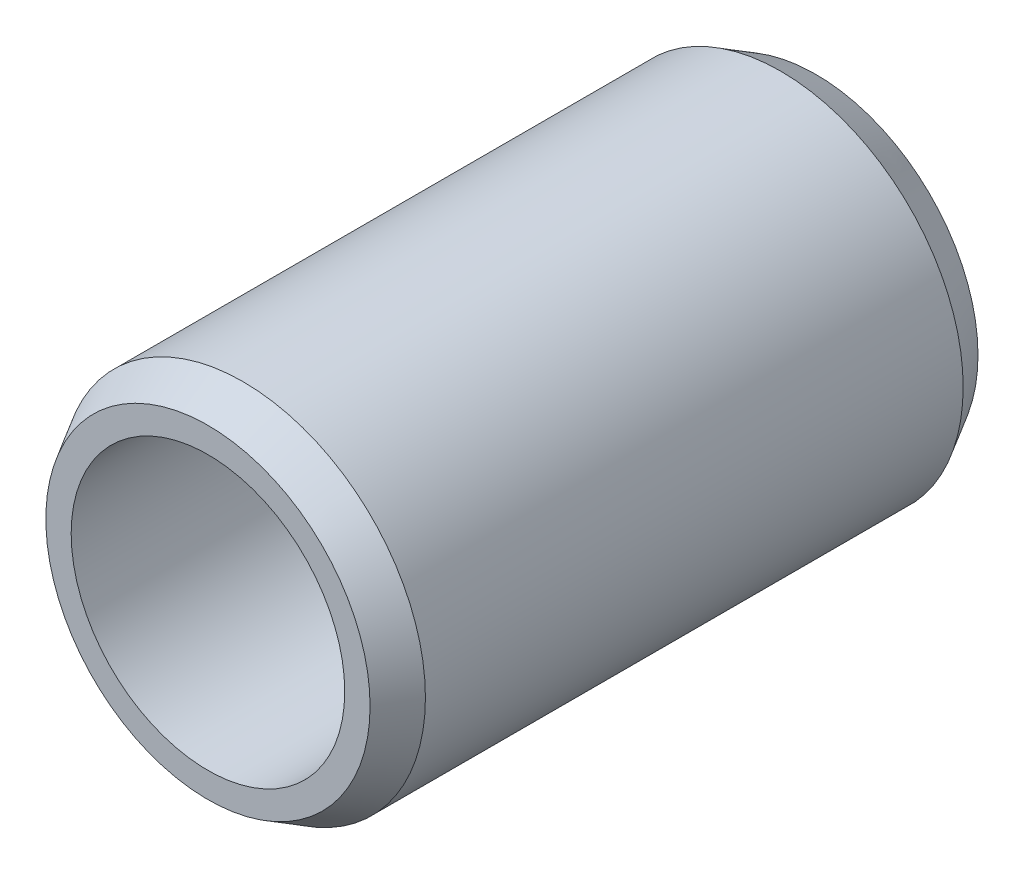
ISO-10303-21;
HEADER;
FILE_DESCRIPTION(('STEP AP214'),'2;1');
FILE_NAME('part.step','',(''),(''),'','','');
FILE_SCHEMA(('AUTOMOTIVE_DESIGN { 1 0 10303 214 1 1 1 1 }'));
ENDSEC;
DATA;
#1=APPLICATION_CONTEXT('core data for automotive mechanical design processes');
#2=APPLICATION_PROTOCOL_DEFINITION('international standard','automotive_design',2000,#1);
#3=PRODUCT_CONTEXT('',#1,'mechanical');
#4=PRODUCT('Part','Part','',(#3));
#5=PRODUCT_RELATED_PRODUCT_CATEGORY('part','',(#4));
#6=PRODUCT_DEFINITION_FORMATION('','',#4);
#7=PRODUCT_DEFINITION_CONTEXT('part definition',#1,'design');
#8=PRODUCT_DEFINITION('design','',#6,#7);
#9=PRODUCT_DEFINITION_SHAPE('','',#8);
#10=(LENGTH_UNIT() NAMED_UNIT(*) SI_UNIT(.MILLI.,.METRE.));
#11=(NAMED_UNIT(*) PLANE_ANGLE_UNIT() SI_UNIT($,.RADIAN.));
#12=(NAMED_UNIT(*) SI_UNIT($,.STERADIAN.) SOLID_ANGLE_UNIT());
#13=UNCERTAINTY_MEASURE_WITH_UNIT(LENGTH_MEASURE(1.E-05),#10,'distance_accuracy_value','');
#14=(GEOMETRIC_REPRESENTATION_CONTEXT(3) GLOBAL_UNCERTAINTY_ASSIGNED_CONTEXT((#13)) GLOBAL_UNIT_ASSIGNED_CONTEXT((#10,
#11,#12)) REPRESENTATION_CONTEXT('',''));
#15=CARTESIAN_POINT('',(0.,0.,0.));
#16=DIRECTION('',(0.,0.,1.));
#17=DIRECTION('',(1.,0.,0.));
#18=AXIS2_PLACEMENT_3D('',#15,#16,#17);
#19=CARTESIAN_POINT('',(0.,0.,15.));
#20=DIRECTION('',(0.,0.,1.));
#21=DIRECTION('',(1.,0.,0.));
#22=AXIS2_PLACEMENT_3D('',#19,#20,#21);
#23=PLANE('',#22);
#24=CARTESIAN_POINT('',(0.,0.,15.));
#25=DIRECTION('',(0.,0.,1.));
#26=DIRECTION('',(1.,0.,0.));
#27=AXIS2_PLACEMENT_3D('',#24,#25,#26);
#28=CIRCLE('',#27,4.);
#29=CARTESIAN_POINT('',(4.,0.,15.));
#30=VERTEX_POINT('',#29);
#31=EDGE_CURVE('E57',#30,#30,#28,.T.);
#32=ORIENTED_EDGE('',*,*,#31,.T.);
#33=EDGE_LOOP('',(#32));
#34=FACE_BOUND('',#33,.T.);
#35=CARTESIAN_POINT('',(0.,0.,15.));
#36=DIRECTION('',(0.,0.,1.));
#37=DIRECTION('',(1.,0.,0.));
#38=AXIS2_PLACEMENT_3D('',#35,#36,#37);
#39=CIRCLE('',#38,3.375);
#40=CARTESIAN_POINT('',(3.375,0.,15.));
#41=VERTEX_POINT('',#40);
#42=EDGE_CURVE('E62',#41,#41,#39,.T.);
#43=ORIENTED_EDGE('',*,*,#42,.F.);
#44=EDGE_LOOP('',(#43));
#45=FACE_BOUND('',#44,.T.);
#46=ADVANCED_FACE('F41',(#34,#45),#23,.T.);
#47=CARTESIAN_POINT('',(0.,0.,0.));
#48=DIRECTION('',(0.,0.,1.));
#49=DIRECTION('',(1.,0.,0.));
#50=AXIS2_PLACEMENT_3D('',#47,#48,#49);
#51=PLANE('',#50);
#52=CARTESIAN_POINT('',(0.,0.,0.));
#53=DIRECTION('',(0.,0.,1.));
#54=DIRECTION('',(1.,0.,0.));
#55=AXIS2_PLACEMENT_3D('',#52,#53,#54);
#56=CIRCLE('',#55,4.);
#57=CARTESIAN_POINT('',(4.,0.,0.));
#58=VERTEX_POINT('',#57);
#59=EDGE_CURVE('E10',#58,#58,#56,.F.);
#60=ORIENTED_EDGE('',*,*,#59,.T.);
#61=EDGE_LOOP('',(#60));
#62=FACE_BOUND('',#61,.T.);
#63=CARTESIAN_POINT('',(0.,0.,0.));
#64=DIRECTION('',(0.,0.,1.));
#65=DIRECTION('',(1.,0.,0.));
#66=AXIS2_PLACEMENT_3D('',#63,#64,#65);
#67=CIRCLE('',#66,3.375);
#68=CARTESIAN_POINT('',(3.375,0.,0.));
#69=VERTEX_POINT('',#68);
#70=EDGE_CURVE('E63',#69,#69,#67,.T.);
#71=ORIENTED_EDGE('',*,*,#70,.T.);
#72=EDGE_LOOP('',(#71));
#73=FACE_BOUND('',#72,.T.);
#74=ADVANCED_FACE('F73',(#62,#73),#51,.F.);
#75=CARTESIAN_POINT('',(0.,0.,15.));
#76=DIRECTION('',(0.,0.,-1.));
#77=DIRECTION('',(-1.,0.,0.));
#78=AXIS2_PLACEMENT_3D('',#75,#76,#77);
#79=CYLINDRICAL_SURFACE('',#78,4.5);
#80=CARTESIAN_POINT('',(0.,0.,14.1339745962156));
#81=DIRECTION('',(0.,0.,1.));
#82=DIRECTION('',(1.,0.,0.));
#83=AXIS2_PLACEMENT_3D('',#80,#81,#82);
#84=CIRCLE('',#83,4.5);
#85=CARTESIAN_POINT('',(4.5,0.,14.1339745962156));
#86=VERTEX_POINT('',#85);
#87=EDGE_CURVE('E49',#86,#86,#84,.F.);
#88=ORIENTED_EDGE('',*,*,#87,.T.);
#89=EDGE_LOOP('',(#88));
#90=FACE_BOUND('',#89,.T.);
#91=CARTESIAN_POINT('',(0.,0.,0.866025403784436));
#92=DIRECTION('',(0.,0.,1.));
#93=DIRECTION('',(1.,0.,0.));
#94=AXIS2_PLACEMENT_3D('',#91,#92,#93);
#95=CIRCLE('',#94,4.5);
#96=CARTESIAN_POINT('',(4.5,0.,0.866025403784436));
#97=VERTEX_POINT('',#96);
#98=EDGE_CURVE('E53',#97,#97,#95,.T.);
#99=ORIENTED_EDGE('',*,*,#98,.T.);
#100=EDGE_LOOP('',(#99));
#101=FACE_BOUND('',#100,.T.);
#102=ADVANCED_FACE('F80',(#90,#101),#79,.T.);
#103=CARTESIAN_POINT('',(0.,0.,15.));
#104=DIRECTION('',(0.,0.,-1.));
#105=DIRECTION('',(-1.,0.,0.));
#106=AXIS2_PLACEMENT_3D('',#103,#104,#105);
#107=CYLINDRICAL_SURFACE('',#106,3.375);
#108=ORIENTED_EDGE('',*,*,#42,.T.);
#109=EDGE_LOOP('',(#108));
#110=FACE_BOUND('',#109,.T.);
#111=ORIENTED_EDGE('',*,*,#70,.F.);
#112=EDGE_LOOP('',(#111));
#113=FACE_BOUND('',#112,.T.);
#114=ADVANCED_FACE('F69',(#110,#113),#107,.F.);
#115=CARTESIAN_POINT('',(0.,0.,15.));
#116=DIRECTION('',(0.,0.,-1.));
#117=DIRECTION('',(-1.,0.,0.));
#118=AXIS2_PLACEMENT_3D('',#115,#116,#117);
#119=CONICAL_SURFACE('',#118,4.,0.5235987755983);
#120=ORIENTED_EDGE('',*,*,#87,.F.);
#121=EDGE_LOOP('',(#120));
#122=FACE_BOUND('',#121,.T.);
#123=ORIENTED_EDGE('',*,*,#31,.F.);
#124=EDGE_LOOP('',(#123));
#125=FACE_BOUND('',#124,.T.);
#126=ADVANCED_FACE('F86',(#122,#125),#119,.T.);
#127=CARTESIAN_POINT('',(0.,0.,0.866025403784436));
#128=DIRECTION('',(0.,0.,1.));
#129=DIRECTION('',(1.,0.,0.));
#130=AXIS2_PLACEMENT_3D('',#127,#128,#129);
#131=CONICAL_SURFACE('',#130,4.5,0.5235987755983);
#132=ORIENTED_EDGE('',*,*,#59,.F.);
#133=EDGE_LOOP('',(#132));
#134=FACE_BOUND('',#133,.T.);
#135=ORIENTED_EDGE('',*,*,#98,.F.);
#136=EDGE_LOOP('',(#135));
#137=FACE_BOUND('',#136,.T.);
#138=ADVANCED_FACE('F44',(#134,#137),#131,.T.);
#139=CLOSED_SHELL('',(#46,#74,#102,#114,#126,#138));
#140=MANIFOLD_SOLID_BREP('B2',#139);
#141=ADVANCED_BREP_SHAPE_REPRESENTATION('',(#18,#140),#14);
#142=SHAPE_DEFINITION_REPRESENTATION(#9,#141);
ENDSEC;
END-ISO-10303-21;
